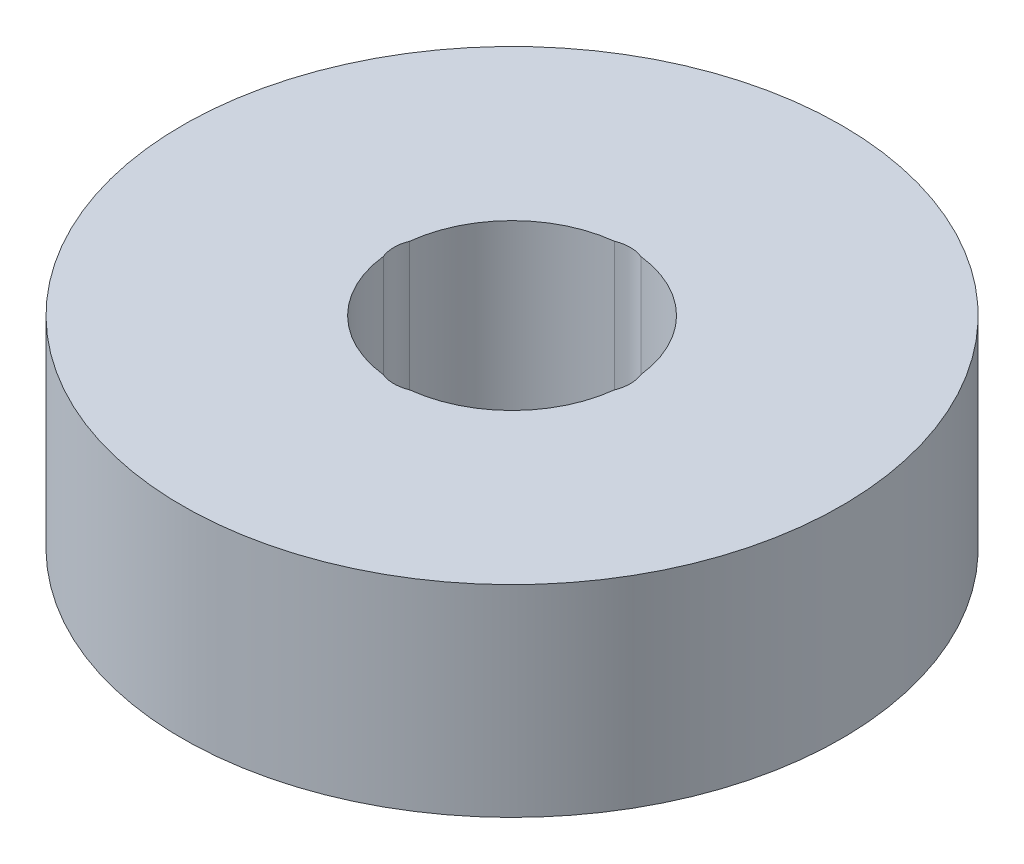
ISO-10303-21;
HEADER;
FILE_DESCRIPTION(('STEP AP214'),'2;1');
FILE_NAME('part.step','',(''),(''),'','','');
FILE_SCHEMA(('AUTOMOTIVE_DESIGN { 1 0 10303 214 1 1 1 1 }'));
ENDSEC;
DATA;
#1=APPLICATION_CONTEXT('core data for automotive mechanical design processes');
#2=APPLICATION_PROTOCOL_DEFINITION('international standard','automotive_design',2000,#1);
#3=PRODUCT_CONTEXT('',#1,'mechanical');
#4=PRODUCT('Part','Part','',(#3));
#5=PRODUCT_RELATED_PRODUCT_CATEGORY('part','',(#4));
#6=PRODUCT_DEFINITION_FORMATION('','',#4);
#7=PRODUCT_DEFINITION_CONTEXT('part definition',#1,'design');
#8=PRODUCT_DEFINITION('design','',#6,#7);
#9=PRODUCT_DEFINITION_SHAPE('','',#8);
#10=(LENGTH_UNIT() NAMED_UNIT(*) SI_UNIT(.MILLI.,.METRE.));
#11=(NAMED_UNIT(*) PLANE_ANGLE_UNIT() SI_UNIT($,.RADIAN.));
#12=(NAMED_UNIT(*) SI_UNIT($,.STERADIAN.) SOLID_ANGLE_UNIT());
#13=UNCERTAINTY_MEASURE_WITH_UNIT(LENGTH_MEASURE(1.E-05),#10,'distance_accuracy_value','');
#14=(GEOMETRIC_REPRESENTATION_CONTEXT(3) GLOBAL_UNCERTAINTY_ASSIGNED_CONTEXT((#13)) GLOBAL_UNIT_ASSIGNED_CONTEXT((#10,
#11,#12)) REPRESENTATION_CONTEXT('',''));
#15=CARTESIAN_POINT('',(0.,0.,0.));
#16=DIRECTION('',(0.,0.,1.));
#17=DIRECTION('',(1.,0.,0.));
#18=AXIS2_PLACEMENT_3D('',#15,#16,#17);
#19=CARTESIAN_POINT('',(0.,26.,0.));
#20=DIRECTION('',(0.,-1.,0.));
#21=DIRECTION('',(0.,0.,-1.));
#22=AXIS2_PLACEMENT_3D('',#19,#20,#21);
#23=CYLINDRICAL_SURFACE('',#22,42.5);
#24=CARTESIAN_POINT('',(0.,26.,0.));
#25=DIRECTION('',(0.,1.,0.));
#26=DIRECTION('',(0.,0.,1.));
#27=AXIS2_PLACEMENT_3D('',#24,#25,#26);
#28=CIRCLE('',#27,42.5);
#29=CARTESIAN_POINT('',(0.,26.,-42.5));
#30=VERTEX_POINT('',#29);
#31=EDGE_CURVE('E148',#30,#30,#28,.T.);
#32=CARTESIAN_POINT('',(0.,0.,0.));
#33=DIRECTION('',(0.,1.,0.));
#34=DIRECTION('',(0.,0.,1.));
#35=AXIS2_PLACEMENT_3D('',#32,#33,#34);
#36=CIRCLE('',#35,42.5);
#37=CARTESIAN_POINT('',(0.,0.,-42.5));
#38=VERTEX_POINT('',#37);
#39=EDGE_CURVE('E139',#38,#38,#36,.T.);
#40=CARTESIAN_POINT('',(0.,26.,-42.5));
#41=CARTESIAN_POINT('',(0.,25.7291666666667,-42.5));
#42=CARTESIAN_POINT('',(0.,25.4583333333333,-42.5));
#43=CARTESIAN_POINT('',(0.,24.9166666666667,-42.5));
#44=CARTESIAN_POINT('',(0.,24.6458333333333,-42.5));
#45=CARTESIAN_POINT('',(0.,24.1041666666667,-42.5));
#46=CARTESIAN_POINT('',(0.,23.8333333333333,-42.5));
#47=CARTESIAN_POINT('',(0.,23.2916666666667,-42.5));
#48=CARTESIAN_POINT('',(0.,23.0208333333333,-42.5));
#49=CARTESIAN_POINT('',(0.,22.4791666666667,-42.5));
#50=CARTESIAN_POINT('',(0.,22.2083333333333,-42.5));
#51=CARTESIAN_POINT('',(0.,21.6666666666667,-42.5));
#52=CARTESIAN_POINT('',(0.,21.3958333333333,-42.5));
#53=CARTESIAN_POINT('',(0.,20.8541666666667,-42.5));
#54=CARTESIAN_POINT('',(0.,20.5833333333333,-42.5));
#55=CARTESIAN_POINT('',(0.,20.0416666666667,-42.5));
#56=CARTESIAN_POINT('',(0.,19.7708333333333,-42.5));
#57=CARTESIAN_POINT('',(0.,19.2291666666667,-42.5));
#58=CARTESIAN_POINT('',(0.,18.9583333333333,-42.5));
#59=CARTESIAN_POINT('',(0.,18.4166666666667,-42.5));
#60=CARTESIAN_POINT('',(0.,18.1458333333333,-42.5));
#61=CARTESIAN_POINT('',(0.,17.6041666666667,-42.5));
#62=CARTESIAN_POINT('',(0.,17.3333333333333,-42.5));
#63=CARTESIAN_POINT('',(0.,16.7916666666667,-42.5));
#64=CARTESIAN_POINT('',(0.,16.5208333333333,-42.5));
#65=CARTESIAN_POINT('',(0.,15.9791666666667,-42.5));
#66=CARTESIAN_POINT('',(0.,15.7083333333333,-42.5));
#67=CARTESIAN_POINT('',(0.,15.1666666666667,-42.5));
#68=CARTESIAN_POINT('',(0.,14.8958333333333,-42.5));
#69=CARTESIAN_POINT('',(0.,14.3541666666667,-42.5));
#70=CARTESIAN_POINT('',(0.,14.0833333333333,-42.5));
#71=CARTESIAN_POINT('',(0.,13.5416666666667,-42.5));
#72=CARTESIAN_POINT('',(0.,13.2708333333333,-42.5));
#73=CARTESIAN_POINT('',(0.,12.7291666666667,-42.5));
#74=CARTESIAN_POINT('',(0.,12.4583333333333,-42.5));
#75=CARTESIAN_POINT('',(0.,11.9166666666667,-42.5));
#76=CARTESIAN_POINT('',(0.,11.6458333333333,-42.5));
#77=CARTESIAN_POINT('',(0.,11.1041666666667,-42.5));
#78=CARTESIAN_POINT('',(0.,10.8333333333333,-42.5));
#79=CARTESIAN_POINT('',(0.,10.2916666666667,-42.5));
#80=CARTESIAN_POINT('',(0.,10.0208333333333,-42.5));
#81=CARTESIAN_POINT('',(0.,9.47916666666667,-42.5));
#82=CARTESIAN_POINT('',(0.,9.20833333333333,-42.5));
#83=CARTESIAN_POINT('',(0.,8.66666666666667,-42.5));
#84=CARTESIAN_POINT('',(0.,8.39583333333333,-42.5));
#85=CARTESIAN_POINT('',(0.,7.85416666666667,-42.5));
#86=CARTESIAN_POINT('',(0.,7.58333333333333,-42.5));
#87=CARTESIAN_POINT('',(0.,7.04166666666667,-42.5));
#88=CARTESIAN_POINT('',(0.,6.77083333333333,-42.5));
#89=CARTESIAN_POINT('',(0.,6.22916666666667,-42.5));
#90=CARTESIAN_POINT('',(0.,5.95833333333333,-42.5));
#91=CARTESIAN_POINT('',(0.,5.41666666666667,-42.5));
#92=CARTESIAN_POINT('',(0.,5.14583333333333,-42.5));
#93=CARTESIAN_POINT('',(0.,4.60416666666667,-42.5));
#94=CARTESIAN_POINT('',(0.,4.33333333333333,-42.5));
#95=CARTESIAN_POINT('',(0.,3.79166666666667,-42.5));
#96=CARTESIAN_POINT('',(0.,3.52083333333333,-42.5));
#97=CARTESIAN_POINT('',(0.,2.97916666666667,-42.5));
#98=CARTESIAN_POINT('',(0.,2.70833333333333,-42.5));
#99=CARTESIAN_POINT('',(0.,2.16666666666667,-42.5));
#100=CARTESIAN_POINT('',(0.,1.89583333333333,-42.5));
#101=CARTESIAN_POINT('',(0.,1.35416666666667,-42.5));
#102=CARTESIAN_POINT('',(0.,1.08333333333333,-42.5));
#103=CARTESIAN_POINT('',(0.,0.541666666666667,-42.5));
#104=CARTESIAN_POINT('',(0.,0.270833333333334,-42.5));
#105=CARTESIAN_POINT('',(0.,0.,-42.5));
#106=B_SPLINE_CURVE_WITH_KNOTS('',3,(#40,#41,#42,#43,#44,#45,#46,#47,#48,#49,#50,#51,#52,#53,
#54,#55,#56,#57,#58,#59,#60,#61,#62,#63,#64,#65,#66,#67,#68,#69,#70,#71,#72,#73,#74,#75,#76,#77,
#78,#79,#80,#81,#82,#83,#84,#85,#86,#87,#88,#89,#90,#91,#92,#93,#94,#95,#96,#97,#98,#99,#100,
#101,#102,#103,#104,#105),.UNSPECIFIED.,.F.,.F.,(4,2,2,2,2,2,2,2,2,2,2,2,2,2,2,2,2,2,2,2,2,2,2,
2,2,2,2,2,2,2,2,2,4),(0.,0.812499999999997,1.625,2.4375,3.25,4.0625,4.875,5.6875,6.5,7.3125,
8.125,8.93749999999999,9.74999999999999,10.5625,11.375,12.1875,13.,13.8125,14.625,15.4375,16.25,
17.0625,17.875,18.6875,19.5,20.3125,21.125,21.9375,22.75,23.5625,24.375,25.1875,26.),.UNSPECIFIED.);
#107=EDGE_CURVE('BSEAM39',#30,#38,#106,.T.);
#108=ORIENTED_EDGE('',*,*,#31,.F.);
#109=ORIENTED_EDGE('',*,*,#39,.T.);
#110=ORIENTED_EDGE('',*,*,#107,.T.);
#111=ORIENTED_EDGE('',*,*,#107,.F.);
#112=EDGE_LOOP('',(#108,#110,#109,#111));
#113=FACE_BOUND('',#112,.T.);
#114=ADVANCED_FACE('F39',(#113),#23,.T.);
#115=CARTESIAN_POINT('',(0.,26.,0.));
#116=DIRECTION('',(0.,1.,0.));
#117=DIRECTION('',(0.,0.,1.));
#118=AXIS2_PLACEMENT_3D('',#115,#116,#117);
#119=PLANE('',#118);
#120=CARTESIAN_POINT('',(0.,26.,10.7441701191897));
#121=DIRECTION('',(0.,1.,0.));
#122=DIRECTION('',(1.,0.,0.));
#123=AXIS2_PLACEMENT_3D('',#120,#121,#122);
#124=CIRCLE('',#123,4.49394923889704);
#125=CARTESIAN_POINT('',(-1.70275489482369,26.,14.9030408228708));
#126=VERTEX_POINT('',#125);
#127=CARTESIAN_POINT('',(1.70275489482379,26.,14.9030408228708));
#128=VERTEX_POINT('',#127);
#129=EDGE_CURVE('E175',#126,#128,#124,.T.);
#130=ORIENTED_EDGE('',*,*,#129,.F.);
#131=CARTESIAN_POINT('',(0.,26.,0.));
#132=DIRECTION('',(0.,1.,0.));
#133=DIRECTION('',(0.,0.,1.));
#134=AXIS2_PLACEMENT_3D('',#131,#132,#133);
#135=CIRCLE('',#134,15.);
#136=CARTESIAN_POINT('',(-14.9030408228708,26.,1.70275489482374));
#137=VERTEX_POINT('',#136);
#138=EDGE_CURVE('E134',#137,#126,#135,.T.);
#139=ORIENTED_EDGE('',*,*,#138,.F.);
#140=CARTESIAN_POINT('',(-10.7441701191897,26.,0.));
#141=DIRECTION('',(0.,1.,0.));
#142=DIRECTION('',(0.,0.,1.));
#143=AXIS2_PLACEMENT_3D('',#140,#141,#142);
#144=CIRCLE('',#143,4.49394923889704);
#145=CARTESIAN_POINT('',(-14.9030408228708,26.,-1.70275489482374));
#146=VERTEX_POINT('',#145);
#147=EDGE_CURVE('E143',#146,#137,#144,.T.);
#148=ORIENTED_EDGE('',*,*,#147,.F.);
#149=CARTESIAN_POINT('',(-1.7027548948239,26.,-14.9030408228708));
#150=VERTEX_POINT('',#149);
#151=EDGE_CURVE('E123',#150,#146,#135,.T.);
#152=ORIENTED_EDGE('',*,*,#151,.F.);
#153=CARTESIAN_POINT('',(-1.1253920841752E-13,26.,-10.7441701191897));
#154=DIRECTION('',(0.,1.,0.));
#155=DIRECTION('',(-1.,0.,0.));
#156=AXIS2_PLACEMENT_3D('',#153,#154,#155);
#157=CIRCLE('',#156,4.49394923889704);
#158=CARTESIAN_POINT('',(1.70275489482359,26.,-14.9030408228708));
#159=VERTEX_POINT('',#158);
#160=EDGE_CURVE('E106',#159,#150,#157,.T.);
#161=ORIENTED_EDGE('',*,*,#160,.F.);
#162=CARTESIAN_POINT('',(14.9030408228708,26.,-1.70275489482374));
#163=VERTEX_POINT('',#162);
#164=EDGE_CURVE('E125',#163,#159,#135,.T.);
#165=ORIENTED_EDGE('',*,*,#164,.F.);
#166=CARTESIAN_POINT('',(10.7441701191897,26.,0.));
#167=DIRECTION('',(0.,1.,0.));
#168=DIRECTION('',(0.,0.,-1.));
#169=AXIS2_PLACEMENT_3D('',#166,#167,#168);
#170=CIRCLE('',#169,4.49394923889704);
#171=CARTESIAN_POINT('',(14.9030408228708,26.,1.70275489482374));
#172=VERTEX_POINT('',#171);
#173=EDGE_CURVE('E286',#172,#163,#170,.T.);
#174=ORIENTED_EDGE('',*,*,#173,.F.);
#175=EDGE_CURVE('E135',#128,#172,#135,.T.);
#176=ORIENTED_EDGE('',*,*,#175,.F.);
#177=EDGE_LOOP('',(#130,#139,#148,#152,#161,#165,#174,#176));
#178=FACE_BOUND('',#177,.T.);
#179=ORIENTED_EDGE('',*,*,#31,.T.);
#180=EDGE_LOOP('',(#179));
#181=FACE_BOUND('',#180,.T.);
#182=ADVANCED_FACE('F118',(#178,#181),#119,.T.);
#183=CARTESIAN_POINT('',(0.,0.,0.));
#184=DIRECTION('',(0.,1.,0.));
#185=DIRECTION('',(0.,0.,1.));
#186=AXIS2_PLACEMENT_3D('',#183,#184,#185);
#187=PLANE('',#186);
#188=CARTESIAN_POINT('',(0.,0.,0.));
#189=DIRECTION('',(0.,1.,0.));
#190=DIRECTION('',(0.,0.,1.));
#191=AXIS2_PLACEMENT_3D('',#188,#189,#190);
#192=CIRCLE('',#191,15.);
#193=CARTESIAN_POINT('',(0.,0.,15.));
#194=VERTEX_POINT('',#193);
#195=EDGE_CURVE('E136',#194,#194,#192,.T.);
#196=ORIENTED_EDGE('',*,*,#195,.T.);
#197=EDGE_LOOP('',(#196));
#198=FACE_BOUND('',#197,.T.);
#199=ORIENTED_EDGE('',*,*,#39,.F.);
#200=EDGE_LOOP('',(#199));
#201=FACE_BOUND('',#200,.T.);
#202=ADVANCED_FACE('F187',(#198,#201),#187,.F.);
#203=CARTESIAN_POINT('',(0.,26.,0.));
#204=DIRECTION('',(0.,-1.,0.));
#205=DIRECTION('',(0.,0.,-1.));
#206=AXIS2_PLACEMENT_3D('',#203,#204,#205);
#207=CYLINDRICAL_SURFACE('',#206,15.);
#208=DIRECTION('',(0.,1.,0.));
#209=VECTOR('',#208,1.);
#210=CARTESIAN_POINT('',(-1.7027548948237,13.3021544887183,14.9030408228708));
#211=LINE('',#210,#209);
#212=CARTESIAN_POINT('',(-1.70275489482369,0.604308977436605,14.9030408228708));
#213=VERTEX_POINT('',#212);
#214=EDGE_CURVE('E11',#213,#126,#211,.T.);
#215=ORIENTED_EDGE('',*,*,#214,.F.);
#216=CARTESIAN_POINT('',(0.,0.604308977436605,0.));
#217=DIRECTION('',(0.,1.,0.));
#218=DIRECTION('',(0.,0.,1.));
#219=AXIS2_PLACEMENT_3D('',#216,#217,#218);
#220=CIRCLE('',#219,15.);
#221=CARTESIAN_POINT('',(1.70275489482379,0.604308977436605,14.9030408228708));
#222=VERTEX_POINT('',#221);
#223=EDGE_CURVE('E170',#213,#222,#220,.T.);
#224=ORIENTED_EDGE('',*,*,#223,.T.);
#225=DIRECTION('',(0.,1.,0.));
#226=VECTOR('',#225,1.);
#227=CARTESIAN_POINT('',(1.7027548948238,13.3021544887183,14.9030408228708));
#228=LINE('',#227,#226);
#229=EDGE_CURVE('E46',#128,#222,#228,.F.);
#230=ORIENTED_EDGE('',*,*,#229,.F.);
#231=ORIENTED_EDGE('',*,*,#175,.T.);
#232=DIRECTION('',(0.,1.,0.));
#233=VECTOR('',#232,1.);
#234=CARTESIAN_POINT('',(14.9030408228708,13.3021544887183,1.70275489482375));
#235=LINE('',#234,#233);
#236=CARTESIAN_POINT('',(14.9030408228708,0.604308977436605,1.70275489482374));
#237=VERTEX_POINT('',#236);
#238=EDGE_CURVE('E164',#237,#172,#235,.T.);
#239=ORIENTED_EDGE('',*,*,#238,.F.);
#240=CARTESIAN_POINT('',(0.,0.604308977436605,0.));
#241=DIRECTION('',(0.,1.,0.));
#242=DIRECTION('',(0.,0.,1.));
#243=AXIS2_PLACEMENT_3D('',#240,#241,#242);
#244=CIRCLE('',#243,15.);
#245=CARTESIAN_POINT('',(14.9030408228708,0.604308977436605,-1.70275489482374));
#246=VERTEX_POINT('',#245);
#247=EDGE_CURVE('E115',#237,#246,#244,.T.);
#248=ORIENTED_EDGE('',*,*,#247,.T.);
#249=DIRECTION('',(0.,1.,0.));
#250=VECTOR('',#249,1.);
#251=CARTESIAN_POINT('',(14.9030408228708,13.3021544887183,-1.70275489482375));
#252=LINE('',#251,#250);
#253=EDGE_CURVE('E131',#163,#246,#252,.F.);
#254=ORIENTED_EDGE('',*,*,#253,.F.);
#255=ORIENTED_EDGE('',*,*,#164,.T.);
#256=DIRECTION('',(0.,1.,0.));
#257=VECTOR('',#256,1.);
#258=CARTESIAN_POINT('',(1.70275489482359,13.3021544887183,-14.9030408228708));
#259=LINE('',#258,#257);
#260=CARTESIAN_POINT('',(1.70275489482359,0.604308977436605,-14.9030408228708));
#261=VERTEX_POINT('',#260);
#262=EDGE_CURVE('E105',#261,#159,#259,.T.);
#263=ORIENTED_EDGE('',*,*,#262,.F.);
#264=CARTESIAN_POINT('',(0.,0.604308977436605,0.));
#265=DIRECTION('',(0.,1.,0.));
#266=DIRECTION('',(0.,0.,1.));
#267=AXIS2_PLACEMENT_3D('',#264,#265,#266);
#268=CIRCLE('',#267,15.);
#269=CARTESIAN_POINT('',(-1.7027548948239,0.604308977436605,-14.9030408228708));
#270=VERTEX_POINT('',#269);
#271=EDGE_CURVE('E159',#261,#270,#268,.T.);
#272=ORIENTED_EDGE('',*,*,#271,.T.);
#273=DIRECTION('',(0.,1.,0.));
#274=VECTOR('',#273,1.);
#275=CARTESIAN_POINT('',(-1.70275489482391,13.3021544887183,-14.9030408228708));
#276=LINE('',#275,#274);
#277=EDGE_CURVE('E114',#150,#270,#276,.F.);
#278=ORIENTED_EDGE('',*,*,#277,.F.);
#279=ORIENTED_EDGE('',*,*,#151,.T.);
#280=DIRECTION('',(0.,1.,0.));
#281=VECTOR('',#280,1.);
#282=CARTESIAN_POINT('',(-14.9030408228708,13.3021544887183,-1.70275489482375));
#283=LINE('',#282,#281);
#284=CARTESIAN_POINT('',(-14.9030408228708,0.604308977436605,-1.70275489482374));
#285=VERTEX_POINT('',#284);
#286=EDGE_CURVE('E160',#285,#146,#283,.T.);
#287=ORIENTED_EDGE('',*,*,#286,.F.);
#288=CARTESIAN_POINT('',(0.,0.604308977436605,0.));
#289=DIRECTION('',(0.,1.,0.));
#290=DIRECTION('',(0.,0.,1.));
#291=AXIS2_PLACEMENT_3D('',#288,#289,#290);
#292=CIRCLE('',#291,15.);
#293=CARTESIAN_POINT('',(-14.9030408228708,0.604308977436605,1.70275489482374));
#294=VERTEX_POINT('',#293);
#295=EDGE_CURVE('E149',#285,#294,#292,.T.);
#296=ORIENTED_EDGE('',*,*,#295,.T.);
#297=DIRECTION('',(0.,1.,0.));
#298=VECTOR('',#297,1.);
#299=CARTESIAN_POINT('',(-14.9030408228708,13.3021544887183,1.70275489482375));
#300=LINE('',#299,#298);
#301=EDGE_CURVE('E152',#137,#294,#300,.F.);
#302=ORIENTED_EDGE('',*,*,#301,.F.);
#303=ORIENTED_EDGE('',*,*,#138,.T.);
#304=EDGE_LOOP('',(#215,#224,#230,#231,#239,#248,#254,#255,#263,#272,#278,#279,#287,#296,#302,#303));
#305=FACE_BOUND('',#304,.T.);
#306=ORIENTED_EDGE('',*,*,#195,.F.);
#307=EDGE_LOOP('',(#306));
#308=FACE_BOUND('',#307,.T.);
#309=ADVANCED_FACE('F126',(#305,#308),#207,.F.);
#310=CARTESIAN_POINT('',(-10.7441701191897,0.604308977436605,0.));
#311=DIRECTION('',(0.,1.,0.));
#312=DIRECTION('',(0.,0.,1.));
#313=AXIS2_PLACEMENT_3D('',#310,#311,#312);
#314=CYLINDRICAL_SURFACE('',#313,4.49394923889704);
#315=ORIENTED_EDGE('',*,*,#286,.T.);
#316=ORIENTED_EDGE('',*,*,#147,.T.);
#317=ORIENTED_EDGE('',*,*,#301,.T.);
#318=CARTESIAN_POINT('',(-10.7441701191897,0.604308977436605,0.));
#319=DIRECTION('',(0.,1.,0.));
#320=DIRECTION('',(0.,0.,1.));
#321=AXIS2_PLACEMENT_3D('',#318,#319,#320);
#322=CIRCLE('',#321,4.49394923889704);
#323=EDGE_CURVE('E144',#285,#294,#322,.T.);
#324=ORIENTED_EDGE('',*,*,#323,.F.);
#325=EDGE_LOOP('',(#315,#316,#317,#324));
#326=FACE_BOUND('',#325,.T.);
#327=ADVANCED_FACE('F200',(#326),#314,.F.);
#328=CARTESIAN_POINT('',(-10.7441701191897,0.604308977436605,0.));
#329=DIRECTION('',(0.,1.,0.));
#330=DIRECTION('',(0.,0.,1.));
#331=AXIS2_PLACEMENT_3D('',#328,#329,#330);
#332=PLANE('',#331);
#333=ORIENTED_EDGE('',*,*,#323,.T.);
#334=ORIENTED_EDGE('',*,*,#295,.F.);
#335=EDGE_LOOP('',(#333,#334));
#336=FACE_BOUND('',#335,.T.);
#337=ADVANCED_FACE('F201',(#336),#332,.T.);
#338=CARTESIAN_POINT('',(-1.1253920841752E-13,0.604308977436605,-10.7441701191897));
#339=DIRECTION('',(0.,1.,0.));
#340=DIRECTION('',(0.,0.,1.));
#341=AXIS2_PLACEMENT_3D('',#338,#339,#340);
#342=CYLINDRICAL_SURFACE('',#341,4.49394923889704);
#343=ORIENTED_EDGE('',*,*,#262,.T.);
#344=ORIENTED_EDGE('',*,*,#160,.T.);
#345=ORIENTED_EDGE('',*,*,#277,.T.);
#346=CARTESIAN_POINT('',(-1.1253920841752E-13,0.604308977436605,-10.7441701191897));
#347=DIRECTION('',(0.,1.,0.));
#348=DIRECTION('',(-1.,0.,0.));
#349=AXIS2_PLACEMENT_3D('',#346,#347,#348);
#350=CIRCLE('',#349,4.49394923889704);
#351=EDGE_CURVE('E107',#261,#270,#350,.T.);
#352=ORIENTED_EDGE('',*,*,#351,.F.);
#353=EDGE_LOOP('',(#343,#344,#345,#352));
#354=FACE_BOUND('',#353,.T.);
#355=ADVANCED_FACE('F102',(#354),#342,.F.);
#356=CARTESIAN_POINT('',(-1.1253920841752E-13,0.604308977436605,-10.7441701191897));
#357=DIRECTION('',(0.,1.,0.));
#358=DIRECTION('',(-1.,0.,0.));
#359=AXIS2_PLACEMENT_3D('',#356,#357,#358);
#360=PLANE('',#359);
#361=ORIENTED_EDGE('',*,*,#351,.T.);
#362=ORIENTED_EDGE('',*,*,#271,.F.);
#363=EDGE_LOOP('',(#361,#362));
#364=FACE_BOUND('',#363,.T.);
#365=ADVANCED_FACE('F209',(#364),#360,.T.);
#366=CARTESIAN_POINT('',(10.7441701191897,0.604308977436605,0.));
#367=DIRECTION('',(0.,1.,0.));
#368=DIRECTION('',(0.,0.,1.));
#369=AXIS2_PLACEMENT_3D('',#366,#367,#368);
#370=CYLINDRICAL_SURFACE('',#369,4.49394923889704);
#371=ORIENTED_EDGE('',*,*,#238,.T.);
#372=ORIENTED_EDGE('',*,*,#173,.T.);
#373=ORIENTED_EDGE('',*,*,#253,.T.);
#374=CARTESIAN_POINT('',(10.7441701191897,0.604308977436605,0.));
#375=DIRECTION('',(0.,1.,0.));
#376=DIRECTION('',(0.,0.,-1.));
#377=AXIS2_PLACEMENT_3D('',#374,#375,#376);
#378=CIRCLE('',#377,4.49394923889704);
#379=EDGE_CURVE('E56',#237,#246,#378,.T.);
#380=ORIENTED_EDGE('',*,*,#379,.F.);
#381=EDGE_LOOP('',(#371,#372,#373,#380));
#382=FACE_BOUND('',#381,.T.);
#383=ADVANCED_FACE('F213',(#382),#370,.F.);
#384=CARTESIAN_POINT('',(10.7441701191897,0.604308977436605,0.));
#385=DIRECTION('',(0.,1.,0.));
#386=DIRECTION('',(0.,0.,-1.));
#387=AXIS2_PLACEMENT_3D('',#384,#385,#386);
#388=PLANE('',#387);
#389=ORIENTED_EDGE('',*,*,#379,.T.);
#390=ORIENTED_EDGE('',*,*,#247,.F.);
#391=EDGE_LOOP('',(#389,#390));
#392=FACE_BOUND('',#391,.T.);
#393=ADVANCED_FACE('F179',(#392),#388,.T.);
#394=CARTESIAN_POINT('',(0.,0.604308977436605,10.7441701191897));
#395=DIRECTION('',(0.,1.,0.));
#396=DIRECTION('',(0.,0.,1.));
#397=AXIS2_PLACEMENT_3D('',#394,#395,#396);
#398=CYLINDRICAL_SURFACE('',#397,4.49394923889704);
#399=ORIENTED_EDGE('',*,*,#214,.T.);
#400=ORIENTED_EDGE('',*,*,#129,.T.);
#401=ORIENTED_EDGE('',*,*,#229,.T.);
#402=CARTESIAN_POINT('',(0.,0.604308977436605,10.7441701191897));
#403=DIRECTION('',(0.,1.,0.));
#404=DIRECTION('',(1.,0.,0.));
#405=AXIS2_PLACEMENT_3D('',#402,#403,#404);
#406=CIRCLE('',#405,4.49394923889704);
#407=EDGE_CURVE('E55',#213,#222,#406,.T.);
#408=ORIENTED_EDGE('',*,*,#407,.F.);
#409=EDGE_LOOP('',(#399,#400,#401,#408));
#410=FACE_BOUND('',#409,.T.);
#411=ADVANCED_FACE('F171',(#410),#398,.F.);
#412=CARTESIAN_POINT('',(0.,0.604308977436605,10.7441701191897));
#413=DIRECTION('',(0.,1.,0.));
#414=DIRECTION('',(1.,0.,0.));
#415=AXIS2_PLACEMENT_3D('',#412,#413,#414);
#416=PLANE('',#415);
#417=ORIENTED_EDGE('',*,*,#407,.T.);
#418=ORIENTED_EDGE('',*,*,#223,.F.);
#419=EDGE_LOOP('',(#417,#418));
#420=FACE_BOUND('',#419,.T.);
#421=ADVANCED_FACE('F173',(#420),#416,.T.);
#422=CLOSED_SHELL('',(#114,#182,#202,#309,#327,#337,#355,#365,#383,#393,#411,#421));
#423=MANIFOLD_SOLID_BREP('B2',#422);
#424=ADVANCED_BREP_SHAPE_REPRESENTATION('',(#18,#423),#14);
#425=SHAPE_DEFINITION_REPRESENTATION(#9,#424);
ENDSEC;
END-ISO-10303-21;
